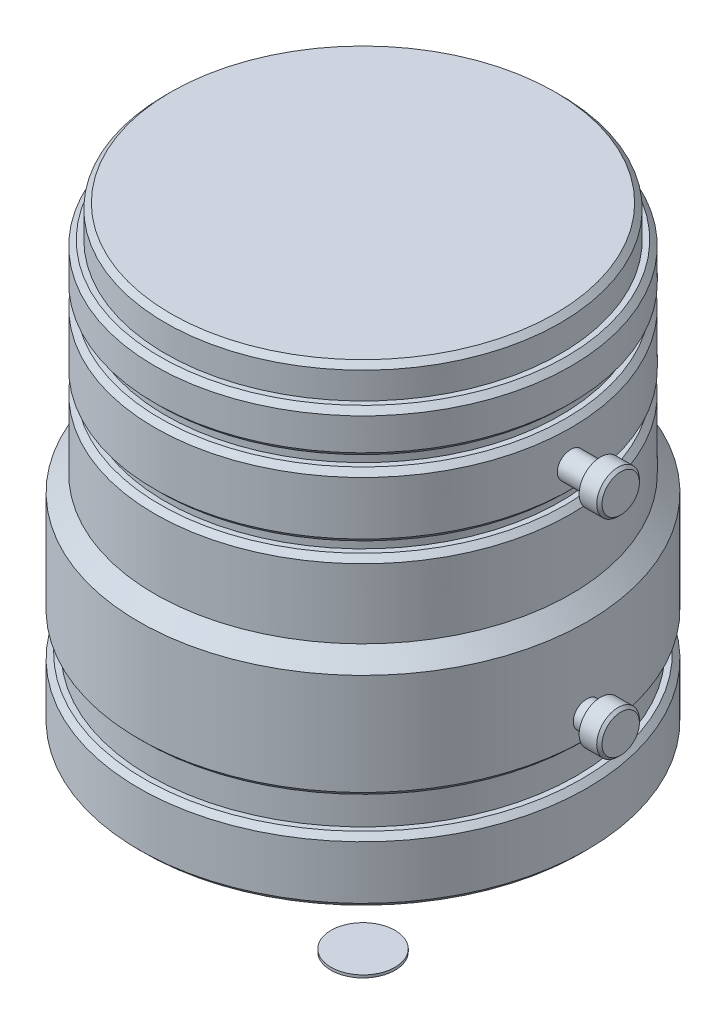
ISO-10303-21;
HEADER;
FILE_DESCRIPTION(('STEP AP214'),'2;1');
FILE_NAME('part.step','',(''),(''),'','','');
FILE_SCHEMA(('AUTOMOTIVE_DESIGN { 1 0 10303 214 1 1 1 1 }'));
ENDSEC;
DATA;
#1=APPLICATION_CONTEXT('core data for automotive mechanical design processes');
#2=APPLICATION_PROTOCOL_DEFINITION('international standard','automotive_design',2000,#1);
#3=PRODUCT_CONTEXT('',#1,'mechanical');
#4=PRODUCT('Part','Part','',(#3));
#5=PRODUCT_RELATED_PRODUCT_CATEGORY('part','',(#4));
#6=PRODUCT_DEFINITION_FORMATION('','',#4);
#7=PRODUCT_DEFINITION_CONTEXT('part definition',#1,'design');
#8=PRODUCT_DEFINITION('design','',#6,#7);
#9=PRODUCT_DEFINITION_SHAPE('','',#8);
#10=(LENGTH_UNIT() NAMED_UNIT(*) SI_UNIT(.MILLI.,.METRE.));
#11=(NAMED_UNIT(*) PLANE_ANGLE_UNIT() SI_UNIT($,.RADIAN.));
#12=(NAMED_UNIT(*) SI_UNIT($,.STERADIAN.) SOLID_ANGLE_UNIT());
#13=UNCERTAINTY_MEASURE_WITH_UNIT(LENGTH_MEASURE(1.E-05),#10,'distance_accuracy_value','');
#14=(GEOMETRIC_REPRESENTATION_CONTEXT(3) GLOBAL_UNCERTAINTY_ASSIGNED_CONTEXT((#13)) GLOBAL_UNIT_ASSIGNED_CONTEXT((#10,
#11,#12)) REPRESENTATION_CONTEXT('',''));
#15=CARTESIAN_POINT('',(0.,0.,0.));
#16=DIRECTION('',(0.,0.,1.));
#17=DIRECTION('',(1.,0.,0.));
#18=AXIS2_PLACEMENT_3D('',#15,#16,#17);
#19=CARTESIAN_POINT('',(0.,-60.53,0.));
#20=DIRECTION('',(0.,-1.,0.));
#21=DIRECTION('',(1.,0.,0.));
#22=AXIS2_PLACEMENT_3D('',#19,#20,#21);
#23=CYLINDRICAL_SURFACE('',#22,3.);
#24=CARTESIAN_POINT('',(0.,-60.53,0.));
#25=DIRECTION('',(0.,1.,0.));
#26=DIRECTION('',(-1.,0.,0.));
#27=AXIS2_PLACEMENT_3D('',#24,#25,#26);
#28=CIRCLE('',#27,3.);
#29=CARTESIAN_POINT('',(-2.99999999999999,-60.53,0.));
#30=VERTEX_POINT('',#29);
#31=EDGE_CURVE('E11',#30,#30,#28,.T.);
#32=ORIENTED_EDGE('',*,*,#31,.F.);
#33=EDGE_LOOP('',(#32));
#34=FACE_BOUND('',#33,.T.);
#35=CARTESIAN_POINT('',(0.,-60.78,0.));
#36=DIRECTION('',(0.,1.,0.));
#37=DIRECTION('',(-1.,0.,0.));
#38=AXIS2_PLACEMENT_3D('',#35,#36,#37);
#39=CIRCLE('',#38,3.);
#40=CARTESIAN_POINT('',(-2.99999999999999,-60.78,0.));
#41=VERTEX_POINT('',#40);
#42=EDGE_CURVE('E50',#41,#41,#39,.T.);
#43=ORIENTED_EDGE('',*,*,#42,.T.);
#44=EDGE_LOOP('',(#43));
#45=FACE_BOUND('',#44,.T.);
#46=ADVANCED_FACE('F47',(#34,#45),#23,.T.);
#47=CARTESIAN_POINT('',(0.,-60.53,0.));
#48=DIRECTION('',(0.,1.,0.));
#49=DIRECTION('',(-1.,0.,0.));
#50=AXIS2_PLACEMENT_3D('',#47,#48,#49);
#51=PLANE('',#50);
#52=ORIENTED_EDGE('',*,*,#31,.T.);
#53=EDGE_LOOP('',(#52));
#54=FACE_BOUND('',#53,.T.);
#55=ADVANCED_FACE('F62',(#54),#51,.T.);
#56=CARTESIAN_POINT('',(0.,-60.78,0.));
#57=DIRECTION('',(0.,1.,0.));
#58=DIRECTION('',(-1.,0.,0.));
#59=AXIS2_PLACEMENT_3D('',#56,#57,#58);
#60=PLANE('',#59);
#61=ORIENTED_EDGE('',*,*,#42,.F.);
#62=EDGE_LOOP('',(#61));
#63=FACE_BOUND('',#62,.T.);
#64=ADVANCED_FACE('F60',(#63),#60,.F.);
#65=CLOSED_SHELL('',(#46,#55,#64));
#66=MANIFOLD_SOLID_BREP('B2',#65);
#67=CARTESIAN_POINT('',(18.5,-11.5,0.));
#68=DIRECTION('',(1.,0.,0.));
#69=DIRECTION('',(0.,1.,0.));
#70=AXIS2_PLACEMENT_3D('',#67,#68,#69);
#71=PLANE('',#70);
#72=CARTESIAN_POINT('',(18.5,-11.5,0.));
#73=DIRECTION('',(1.,0.,0.));
#74=DIRECTION('',(0.,1.,0.));
#75=AXIS2_PLACEMENT_3D('',#72,#73,#74);
#76=CIRCLE('',#75,1.25);
#77=CARTESIAN_POINT('',(18.5,-10.25,0.));
#78=VERTEX_POINT('',#77);
#79=EDGE_CURVE('E107',#78,#78,#76,.T.);
#80=ORIENTED_EDGE('',*,*,#79,.F.);
#81=EDGE_LOOP('',(#80));
#82=FACE_BOUND('',#81,.T.);
#83=ADVANCED_FACE('F95',(#82),#71,.F.);
#84=CARTESIAN_POINT('',(24.15,-11.5,0.));
#85=DIRECTION('',(1.,0.,0.));
#86=DIRECTION('',(0.,1.,0.));
#87=AXIS2_PLACEMENT_3D('',#84,#85,#86);
#88=CYLINDRICAL_SURFACE('',#87,1.25);
#89=CARTESIAN_POINT('',(22.25,-11.5,0.));
#90=DIRECTION('',(1.,0.,0.));
#91=DIRECTION('',(0.,1.,0.));
#92=AXIS2_PLACEMENT_3D('',#89,#90,#91);
#93=CIRCLE('',#92,1.25);
#94=CARTESIAN_POINT('',(22.25,-10.25,0.));
#95=VERTEX_POINT('',#94);
#96=EDGE_CURVE('E111',#95,#95,#93,.T.);
#97=ORIENTED_EDGE('',*,*,#96,.F.);
#98=EDGE_LOOP('',(#97));
#99=FACE_BOUND('',#98,.T.);
#100=ORIENTED_EDGE('',*,*,#79,.T.);
#101=EDGE_LOOP('',(#100));
#102=FACE_BOUND('',#101,.T.);
#103=ADVANCED_FACE('F125',(#99,#102),#88,.T.);
#104=CARTESIAN_POINT('',(22.25,-12.75,0.));
#105=DIRECTION('',(1.,0.,0.));
#106=DIRECTION('',(0.,1.,0.));
#107=AXIS2_PLACEMENT_3D('',#104,#105,#106);
#108=PLANE('',#107);
#109=CARTESIAN_POINT('',(22.25,-11.5,0.));
#110=DIRECTION('',(1.,0.,0.));
#111=DIRECTION('',(0.,1.,0.));
#112=AXIS2_PLACEMENT_3D('',#109,#110,#111);
#113=CIRCLE('',#112,2.);
#114=CARTESIAN_POINT('',(22.25,-9.49999999999999,0.));
#115=VERTEX_POINT('',#114);
#116=EDGE_CURVE('E116',#115,#115,#113,.T.);
#117=ORIENTED_EDGE('',*,*,#116,.F.);
#118=EDGE_LOOP('',(#117));
#119=FACE_BOUND('',#118,.T.);
#120=ORIENTED_EDGE('',*,*,#96,.T.);
#121=EDGE_LOOP('',(#120));
#122=FACE_BOUND('',#121,.T.);
#123=ADVANCED_FACE('F122',(#119,#122),#108,.F.);
#124=CARTESIAN_POINT('',(24.15,-11.5,0.));
#125=DIRECTION('',(1.,0.,0.));
#126=DIRECTION('',(0.,1.,0.));
#127=AXIS2_PLACEMENT_3D('',#124,#125,#126);
#128=CYLINDRICAL_SURFACE('',#127,2.);
#129=CARTESIAN_POINT('',(23.9,-11.5,0.));
#130=DIRECTION('',(-1.,0.,0.));
#131=DIRECTION('',(0.,0.,1.));
#132=AXIS2_PLACEMENT_3D('',#129,#130,#131);
#133=CIRCLE('',#132,2.);
#134=CARTESIAN_POINT('',(23.9,-11.5,2.));
#135=VERTEX_POINT('',#134);
#136=EDGE_CURVE('E46',#135,#135,#133,.T.);
#137=ORIENTED_EDGE('',*,*,#136,.T.);
#138=EDGE_LOOP('',(#137));
#139=FACE_BOUND('',#138,.T.);
#140=ORIENTED_EDGE('',*,*,#116,.T.);
#141=EDGE_LOOP('',(#140));
#142=FACE_BOUND('',#141,.T.);
#143=ADVANCED_FACE('F120',(#139,#142),#128,.T.);
#144=CARTESIAN_POINT('',(24.15,-13.5,0.));
#145=DIRECTION('',(-1.,0.,0.));
#146=DIRECTION('',(0.,-1.,0.));
#147=AXIS2_PLACEMENT_3D('',#144,#145,#146);
#148=PLANE('',#147);
#149=CARTESIAN_POINT('',(24.15,-11.5,0.));
#150=DIRECTION('',(-1.,0.,0.));
#151=DIRECTION('',(0.,-1.,0.));
#152=AXIS2_PLACEMENT_3D('',#149,#150,#151);
#153=CIRCLE('',#152,1.75000000000001);
#154=CARTESIAN_POINT('',(24.15,-13.25,0.));
#155=VERTEX_POINT('',#154);
#156=EDGE_CURVE('E103',#155,#155,#153,.F.);
#157=ORIENTED_EDGE('',*,*,#156,.T.);
#158=EDGE_LOOP('',(#157));
#159=FACE_BOUND('',#158,.T.);
#160=ADVANCED_FACE('F140',(#159),#148,.F.);
#161=CARTESIAN_POINT('',(24.15,-11.5,0.));
#162=DIRECTION('',(-1.,0.,0.));
#163=DIRECTION('',(0.,0.,1.));
#164=AXIS2_PLACEMENT_3D('',#161,#162,#163);
#165=CONICAL_SURFACE('',#164,1.75000000000001,0.785398163397445);
#166=ORIENTED_EDGE('',*,*,#136,.F.);
#167=EDGE_LOOP('',(#166));
#168=FACE_BOUND('',#167,.T.);
#169=ORIENTED_EDGE('',*,*,#156,.F.);
#170=EDGE_LOOP('',(#169));
#171=FACE_BOUND('',#170,.T.);
#172=ADVANCED_FACE('F98',(#168,#171),#165,.T.);
#173=CLOSED_SHELL('',(#83,#103,#123,#143,#160,#172));
#174=MANIFOLD_SOLID_BREP('B6',#173);
#175=CARTESIAN_POINT('',(20.,-32.25,0.));
#176=DIRECTION('',(1.,0.,0.));
#177=DIRECTION('',(0.,0.,-1.));
#178=AXIS2_PLACEMENT_3D('',#175,#176,#177);
#179=PLANE('',#178);
#180=CARTESIAN_POINT('',(20.,-31.,0.));
#181=DIRECTION('',(1.,0.,0.));
#182=DIRECTION('',(0.,0.,-1.));
#183=AXIS2_PLACEMENT_3D('',#180,#181,#182);
#184=CIRCLE('',#183,1.25);
#185=CARTESIAN_POINT('',(20.,-31.,-1.25));
#186=VERTEX_POINT('',#185);
#187=EDGE_CURVE('E202',#186,#186,#184,.T.);
#188=ORIENTED_EDGE('',*,*,#187,.F.);
#189=EDGE_LOOP('',(#188));
#190=FACE_BOUND('',#189,.T.);
#191=ADVANCED_FACE('F190',(#190),#179,.F.);
#192=CARTESIAN_POINT('',(24.15,-31.,0.));
#193=DIRECTION('',(1.,0.,0.));
#194=DIRECTION('',(0.,0.,-1.));
#195=AXIS2_PLACEMENT_3D('',#192,#193,#194);
#196=CYLINDRICAL_SURFACE('',#195,1.25);
#197=CARTESIAN_POINT('',(22.25,-31.,0.));
#198=DIRECTION('',(1.,0.,0.));
#199=DIRECTION('',(0.,0.,-1.));
#200=AXIS2_PLACEMENT_3D('',#197,#198,#199);
#201=CIRCLE('',#200,1.25);
#202=CARTESIAN_POINT('',(22.25,-31.,-1.25));
#203=VERTEX_POINT('',#202);
#204=EDGE_CURVE('E206',#203,#203,#201,.T.);
#205=ORIENTED_EDGE('',*,*,#204,.F.);
#206=EDGE_LOOP('',(#205));
#207=FACE_BOUND('',#206,.T.);
#208=ORIENTED_EDGE('',*,*,#187,.T.);
#209=EDGE_LOOP('',(#208));
#210=FACE_BOUND('',#209,.T.);
#211=ADVANCED_FACE('F220',(#207,#210),#196,.T.);
#212=CARTESIAN_POINT('',(22.25,-32.25,0.));
#213=DIRECTION('',(1.,0.,0.));
#214=DIRECTION('',(0.,0.,-1.));
#215=AXIS2_PLACEMENT_3D('',#212,#213,#214);
#216=PLANE('',#215);
#217=CARTESIAN_POINT('',(22.25,-31.,0.));
#218=DIRECTION('',(1.,0.,0.));
#219=DIRECTION('',(0.,0.,-1.));
#220=AXIS2_PLACEMENT_3D('',#217,#218,#219);
#221=CIRCLE('',#220,2.);
#222=CARTESIAN_POINT('',(22.25,-31.,-2.));
#223=VERTEX_POINT('',#222);
#224=EDGE_CURVE('E211',#223,#223,#221,.T.);
#225=ORIENTED_EDGE('',*,*,#224,.F.);
#226=EDGE_LOOP('',(#225));
#227=FACE_BOUND('',#226,.T.);
#228=ORIENTED_EDGE('',*,*,#204,.T.);
#229=EDGE_LOOP('',(#228));
#230=FACE_BOUND('',#229,.T.);
#231=ADVANCED_FACE('F217',(#227,#230),#216,.F.);
#232=CARTESIAN_POINT('',(24.15,-31.,0.));
#233=DIRECTION('',(1.,0.,0.));
#234=DIRECTION('',(0.,0.,-1.));
#235=AXIS2_PLACEMENT_3D('',#232,#233,#234);
#236=CYLINDRICAL_SURFACE('',#235,2.);
#237=CARTESIAN_POINT('',(23.9,-31.,0.));
#238=DIRECTION('',(-1.,0.,0.));
#239=DIRECTION('',(0.,0.,1.));
#240=AXIS2_PLACEMENT_3D('',#237,#238,#239);
#241=CIRCLE('',#240,2.);
#242=CARTESIAN_POINT('',(23.9,-31.,2.));
#243=VERTEX_POINT('',#242);
#244=EDGE_CURVE('E94',#243,#243,#241,.T.);
#245=ORIENTED_EDGE('',*,*,#244,.T.);
#246=EDGE_LOOP('',(#245));
#247=FACE_BOUND('',#246,.T.);
#248=ORIENTED_EDGE('',*,*,#224,.T.);
#249=EDGE_LOOP('',(#248));
#250=FACE_BOUND('',#249,.T.);
#251=ADVANCED_FACE('F215',(#247,#250),#236,.T.);
#252=CARTESIAN_POINT('',(24.15,-33.,0.));
#253=DIRECTION('',(-1.,0.,0.));
#254=DIRECTION('',(0.,0.,1.));
#255=AXIS2_PLACEMENT_3D('',#252,#253,#254);
#256=PLANE('',#255);
#257=CARTESIAN_POINT('',(24.15,-31.,0.));
#258=DIRECTION('',(-1.,0.,0.));
#259=DIRECTION('',(0.,0.,1.));
#260=AXIS2_PLACEMENT_3D('',#257,#258,#259);
#261=CIRCLE('',#260,1.75);
#262=CARTESIAN_POINT('',(24.15,-31.,1.75));
#263=VERTEX_POINT('',#262);
#264=EDGE_CURVE('E198',#263,#263,#261,.F.);
#265=ORIENTED_EDGE('',*,*,#264,.T.);
#266=EDGE_LOOP('',(#265));
#267=FACE_BOUND('',#266,.T.);
#268=ADVANCED_FACE('F235',(#267),#256,.F.);
#269=CARTESIAN_POINT('',(24.15,-31.,0.));
#270=DIRECTION('',(-1.,0.,0.));
#271=DIRECTION('',(0.,0.,1.));
#272=AXIS2_PLACEMENT_3D('',#269,#270,#271);
#273=CONICAL_SURFACE('',#272,1.75,0.785398163397445);
#274=ORIENTED_EDGE('',*,*,#244,.F.);
#275=EDGE_LOOP('',(#274));
#276=FACE_BOUND('',#275,.T.);
#277=ORIENTED_EDGE('',*,*,#264,.F.);
#278=EDGE_LOOP('',(#277));
#279=FACE_BOUND('',#278,.T.);
#280=ADVANCED_FACE('F193',(#276,#279),#273,.T.);
#281=CLOSED_SHELL('',(#191,#211,#231,#251,#268,#280));
#282=MANIFOLD_SOLID_BREP('B41',#281);
#283=CARTESIAN_POINT('',(0.,0.,0.));
#284=DIRECTION('',(0.,-1.,0.));
#285=DIRECTION('',(1.,0.,0.));
#286=AXIS2_PLACEMENT_3D('',#283,#284,#285);
#287=PLANE('',#286);
#288=CARTESIAN_POINT('',(0.,0.,0.));
#289=DIRECTION('',(0.,-1.,0.));
#290=DIRECTION('',(1.,0.,0.));
#291=AXIS2_PLACEMENT_3D('',#288,#289,#290);
#292=CIRCLE('',#291,18.);
#293=CARTESIAN_POINT('',(18.,0.,0.));
#294=VERTEX_POINT('',#293);
#295=EDGE_CURVE('E305',#294,#294,#292,.F.);
#296=ORIENTED_EDGE('',*,*,#295,.T.);
#297=EDGE_LOOP('',(#296));
#298=FACE_BOUND('',#297,.T.);
#299=ADVANCED_FACE('F278',(#298),#287,.F.);
#300=CARTESIAN_POINT('',(0.,0.,0.));
#301=DIRECTION('',(0.,1.,0.));
#302=DIRECTION('',(-1.,0.,0.));
#303=AXIS2_PLACEMENT_3D('',#300,#301,#302);
#304=CYLINDRICAL_SURFACE('',#303,18.5);
#305=CARTESIAN_POINT('',(0.,-0.49999999999997,0.));
#306=DIRECTION('',(0.,-1.,0.));
#307=DIRECTION('',(1.,0.,0.));
#308=AXIS2_PLACEMENT_3D('',#305,#306,#307);
#309=CIRCLE('',#308,18.5);
#310=CARTESIAN_POINT('',(18.5,-0.499999999999968,0.));
#311=VERTEX_POINT('',#310);
#312=EDGE_CURVE('E302',#311,#311,#309,.T.);
#313=ORIENTED_EDGE('',*,*,#312,.T.);
#314=EDGE_LOOP('',(#313));
#315=FACE_BOUND('',#314,.T.);
#316=CARTESIAN_POINT('',(0.,-3.,0.));
#317=DIRECTION('',(0.,1.,0.));
#318=DIRECTION('',(-1.,0.,0.));
#319=AXIS2_PLACEMENT_3D('',#316,#317,#318);
#320=CIRCLE('',#319,18.5);
#321=CARTESIAN_POINT('',(-18.5,-3.,0.));
#322=VERTEX_POINT('',#321);
#323=EDGE_CURVE('E359',#322,#322,#320,.T.);
#324=ORIENTED_EDGE('',*,*,#323,.T.);
#325=EDGE_LOOP('',(#324));
#326=FACE_BOUND('',#325,.T.);
#327=ADVANCED_FACE('F422',(#315,#326),#304,.T.);
#328=CARTESIAN_POINT('',(18.5,-3.,0.));
#329=DIRECTION('',(0.,-1.,0.));
#330=DIRECTION('',(1.,0.,0.));
#331=AXIS2_PLACEMENT_3D('',#328,#329,#330);
#332=PLANE('',#331);
#333=CARTESIAN_POINT('',(0.,-3.,0.));
#334=DIRECTION('',(0.,-1.,0.));
#335=DIRECTION('',(1.,0.,0.));
#336=AXIS2_PLACEMENT_3D('',#333,#334,#335);
#337=CIRCLE('',#336,19.);
#338=CARTESIAN_POINT('',(19.,-3.,0.));
#339=VERTEX_POINT('',#338);
#340=EDGE_CURVE('E308',#339,#339,#337,.F.);
#341=ORIENTED_EDGE('',*,*,#340,.T.);
#342=EDGE_LOOP('',(#341));
#343=FACE_BOUND('',#342,.T.);
#344=ORIENTED_EDGE('',*,*,#323,.F.);
#345=EDGE_LOOP('',(#344));
#346=FACE_BOUND('',#345,.T.);
#347=ADVANCED_FACE('F428',(#343,#346),#332,.F.);
#348=CARTESIAN_POINT('',(0.,0.,0.));
#349=DIRECTION('',(0.,1.,0.));
#350=DIRECTION('',(-1.,0.,0.));
#351=AXIS2_PLACEMENT_3D('',#348,#349,#350);
#352=CYLINDRICAL_SURFACE('',#351,19.5);
#353=CARTESIAN_POINT('',(0.,-6.5,0.));
#354=DIRECTION('',(0.,1.,0.));
#355=DIRECTION('',(-1.,0.,0.));
#356=AXIS2_PLACEMENT_3D('',#353,#354,#355);
#357=CIRCLE('',#356,19.5);
#358=CARTESIAN_POINT('',(-19.5,-6.50000000000001,0.));
#359=VERTEX_POINT('',#358);
#360=EDGE_CURVE('E314',#359,#359,#357,.T.);
#361=ORIENTED_EDGE('',*,*,#360,.T.);
#362=EDGE_LOOP('',(#361));
#363=FACE_BOUND('',#362,.T.);
#364=CARTESIAN_POINT('',(0.,-3.49999999999996,0.));
#365=DIRECTION('',(0.,-1.,0.));
#366=DIRECTION('',(1.,0.,0.));
#367=AXIS2_PLACEMENT_3D('',#364,#365,#366);
#368=CIRCLE('',#367,19.5);
#369=CARTESIAN_POINT('',(19.5,-3.49999999999996,0.));
#370=VERTEX_POINT('',#369);
#371=EDGE_CURVE('E317',#370,#370,#368,.T.);
#372=ORIENTED_EDGE('',*,*,#371,.T.);
#373=EDGE_LOOP('',(#372));
#374=FACE_BOUND('',#373,.T.);
#375=ADVANCED_FACE('F590',(#363,#374),#352,.T.);
#376=CARTESIAN_POINT('',(19.5,-7.,0.));
#377=DIRECTION('',(0.,1.,0.));
#378=DIRECTION('',(-1.,0.,0.));
#379=AXIS2_PLACEMENT_3D('',#376,#377,#378);
#380=PLANE('',#379);
#381=CARTESIAN_POINT('',(0.,-7.,0.));
#382=DIRECTION('',(0.,1.,0.));
#383=DIRECTION('',(-1.,0.,0.));
#384=AXIS2_PLACEMENT_3D('',#381,#382,#383);
#385=CIRCLE('',#384,19.);
#386=CARTESIAN_POINT('',(-19.,-7.00000000000001,0.));
#387=VERTEX_POINT('',#386);
#388=EDGE_CURVE('E311',#387,#387,#385,.F.);
#389=ORIENTED_EDGE('',*,*,#388,.T.);
#390=EDGE_LOOP('',(#389));
#391=FACE_BOUND('',#390,.T.);
#392=CARTESIAN_POINT('',(0.,-7.,0.));
#393=DIRECTION('',(0.,1.,0.));
#394=DIRECTION('',(-1.,0.,0.));
#395=AXIS2_PLACEMENT_3D('',#392,#393,#394);
#396=CIRCLE('',#395,18.5);
#397=CARTESIAN_POINT('',(-18.5,-7.00000000000001,0.));
#398=VERTEX_POINT('',#397);
#399=EDGE_CURVE('E362',#398,#398,#396,.T.);
#400=ORIENTED_EDGE('',*,*,#399,.T.);
#401=EDGE_LOOP('',(#400));
#402=FACE_BOUND('',#401,.T.);
#403=ADVANCED_FACE('F586',(#391,#402),#380,.F.);
#404=CARTESIAN_POINT('',(0.,0.,0.));
#405=DIRECTION('',(0.,1.,0.));
#406=DIRECTION('',(-1.,0.,0.));
#407=AXIS2_PLACEMENT_3D('',#404,#405,#406);
#408=CYLINDRICAL_SURFACE('',#407,18.5);
#409=ORIENTED_EDGE('',*,*,#399,.F.);
#410=EDGE_LOOP('',(#409));
#411=FACE_BOUND('',#410,.T.);
#412=CARTESIAN_POINT('',(0.,-8.,0.));
#413=DIRECTION('',(0.,1.,0.));
#414=DIRECTION('',(-1.,0.,0.));
#415=AXIS2_PLACEMENT_3D('',#412,#413,#414);
#416=CIRCLE('',#415,18.5);
#417=CARTESIAN_POINT('',(-18.5,-8.,0.));
#418=VERTEX_POINT('',#417);
#419=EDGE_CURVE('E365',#418,#418,#416,.T.);
#420=ORIENTED_EDGE('',*,*,#419,.T.);
#421=EDGE_LOOP('',(#420));
#422=FACE_BOUND('',#421,.T.);
#423=ADVANCED_FACE('F582',(#411,#422),#408,.T.);
#424=CARTESIAN_POINT('',(18.5,-8.,0.));
#425=DIRECTION('',(0.,-1.,0.));
#426=DIRECTION('',(1.,0.,0.));
#427=AXIS2_PLACEMENT_3D('',#424,#425,#426);
#428=PLANE('',#427);
#429=CARTESIAN_POINT('',(0.,-8.,0.));
#430=DIRECTION('',(0.,-1.,0.));
#431=DIRECTION('',(1.,0.,0.));
#432=AXIS2_PLACEMENT_3D('',#429,#430,#431);
#433=CIRCLE('',#432,19.);
#434=CARTESIAN_POINT('',(19.,-8.,0.));
#435=VERTEX_POINT('',#434);
#436=EDGE_CURVE('E320',#435,#435,#433,.F.);
#437=ORIENTED_EDGE('',*,*,#436,.T.);
#438=EDGE_LOOP('',(#437));
#439=FACE_BOUND('',#438,.T.);
#440=ORIENTED_EDGE('',*,*,#419,.F.);
#441=EDGE_LOOP('',(#440));
#442=FACE_BOUND('',#441,.T.);
#443=ADVANCED_FACE('F578',(#439,#442),#428,.F.);
#444=CARTESIAN_POINT('',(0.,0.,0.));
#445=DIRECTION('',(0.,1.,0.));
#446=DIRECTION('',(-1.,0.,0.));
#447=AXIS2_PLACEMENT_3D('',#444,#445,#446);
#448=CYLINDRICAL_SURFACE('',#447,19.5);
#449=CARTESIAN_POINT('',(0.,-13.5,0.));
#450=DIRECTION('',(0.,1.,0.));
#451=DIRECTION('',(-1.,0.,0.));
#452=AXIS2_PLACEMENT_3D('',#449,#450,#451);
#453=CIRCLE('',#452,19.5);
#454=CARTESIAN_POINT('',(-19.5,-13.5,0.));
#455=VERTEX_POINT('',#454);
#456=EDGE_CURVE('E326',#455,#455,#453,.T.);
#457=ORIENTED_EDGE('',*,*,#456,.T.);
#458=EDGE_LOOP('',(#457));
#459=FACE_BOUND('',#458,.T.);
#460=CARTESIAN_POINT('',(0.,-8.5,0.));
#461=DIRECTION('',(0.,-1.,0.));
#462=DIRECTION('',(1.,0.,0.));
#463=AXIS2_PLACEMENT_3D('',#460,#461,#462);
#464=CIRCLE('',#463,19.5);
#465=CARTESIAN_POINT('',(19.5,-8.5,0.));
#466=VERTEX_POINT('',#465);
#467=EDGE_CURVE('E329',#466,#466,#464,.T.);
#468=ORIENTED_EDGE('',*,*,#467,.T.);
#469=EDGE_LOOP('',(#468));
#470=FACE_BOUND('',#469,.T.);
#471=ADVANCED_FACE('F574',(#459,#470),#448,.T.);
#472=CARTESIAN_POINT('',(19.5,-14.,0.));
#473=DIRECTION('',(0.,1.,0.));
#474=DIRECTION('',(-1.,0.,0.));
#475=AXIS2_PLACEMENT_3D('',#472,#473,#474);
#476=PLANE('',#475);
#477=CARTESIAN_POINT('',(0.,-14.,0.));
#478=DIRECTION('',(0.,1.,0.));
#479=DIRECTION('',(-1.,0.,0.));
#480=AXIS2_PLACEMENT_3D('',#477,#478,#479);
#481=CIRCLE('',#480,19.);
#482=CARTESIAN_POINT('',(-19.,-14.,0.));
#483=VERTEX_POINT('',#482);
#484=EDGE_CURVE('E323',#483,#483,#481,.F.);
#485=ORIENTED_EDGE('',*,*,#484,.T.);
#486=EDGE_LOOP('',(#485));
#487=FACE_BOUND('',#486,.T.);
#488=CARTESIAN_POINT('',(0.,-14.,0.));
#489=DIRECTION('',(0.,1.,0.));
#490=DIRECTION('',(-1.,0.,0.));
#491=AXIS2_PLACEMENT_3D('',#488,#489,#490);
#492=CIRCLE('',#491,18.5);
#493=CARTESIAN_POINT('',(-18.5,-14.,0.));
#494=VERTEX_POINT('',#493);
#495=EDGE_CURVE('E368',#494,#494,#492,.T.);
#496=ORIENTED_EDGE('',*,*,#495,.T.);
#497=EDGE_LOOP('',(#496));
#498=FACE_BOUND('',#497,.T.);
#499=ADVANCED_FACE('F570',(#487,#498),#476,.F.);
#500=CARTESIAN_POINT('',(0.,0.,0.));
#501=DIRECTION('',(0.,1.,0.));
#502=DIRECTION('',(-1.,0.,0.));
#503=AXIS2_PLACEMENT_3D('',#500,#501,#502);
#504=CYLINDRICAL_SURFACE('',#503,18.5);
#505=ORIENTED_EDGE('',*,*,#495,.F.);
#506=EDGE_LOOP('',(#505));
#507=FACE_BOUND('',#506,.T.);
#508=CARTESIAN_POINT('',(0.,-15.,0.));
#509=DIRECTION('',(0.,1.,0.));
#510=DIRECTION('',(-1.,0.,0.));
#511=AXIS2_PLACEMENT_3D('',#508,#509,#510);
#512=CIRCLE('',#511,18.5);
#513=CARTESIAN_POINT('',(-18.5,-15.,0.));
#514=VERTEX_POINT('',#513);
#515=EDGE_CURVE('E371',#514,#514,#512,.T.);
#516=ORIENTED_EDGE('',*,*,#515,.T.);
#517=EDGE_LOOP('',(#516));
#518=FACE_BOUND('',#517,.T.);
#519=ADVANCED_FACE('F566',(#507,#518),#504,.T.);
#520=CARTESIAN_POINT('',(18.5,-15.,0.));
#521=DIRECTION('',(0.,-1.,0.));
#522=DIRECTION('',(1.,0.,0.));
#523=AXIS2_PLACEMENT_3D('',#520,#521,#522);
#524=PLANE('',#523);
#525=CARTESIAN_POINT('',(0.,-15.,0.));
#526=DIRECTION('',(0.,-1.,0.));
#527=DIRECTION('',(1.,0.,0.));
#528=AXIS2_PLACEMENT_3D('',#525,#526,#527);
#529=CIRCLE('',#528,19.);
#530=CARTESIAN_POINT('',(19.,-15.,0.));
#531=VERTEX_POINT('',#530);
#532=EDGE_CURVE('E335',#531,#531,#529,.F.);
#533=ORIENTED_EDGE('',*,*,#532,.T.);
#534=EDGE_LOOP('',(#533));
#535=FACE_BOUND('',#534,.T.);
#536=ORIENTED_EDGE('',*,*,#515,.F.);
#537=EDGE_LOOP('',(#536));
#538=FACE_BOUND('',#537,.T.);
#539=ADVANCED_FACE('F562',(#535,#538),#524,.F.);
#540=CARTESIAN_POINT('',(0.,0.,0.));
#541=DIRECTION('',(0.,1.,0.));
#542=DIRECTION('',(-1.,0.,0.));
#543=AXIS2_PLACEMENT_3D('',#540,#541,#542);
#544=CYLINDRICAL_SURFACE('',#543,19.5);
#545=CARTESIAN_POINT('',(0.,-15.5,0.));
#546=DIRECTION('',(0.,-1.,0.));
#547=DIRECTION('',(1.,0.,0.));
#548=AXIS2_PLACEMENT_3D('',#545,#546,#547);
#549=CIRCLE('',#548,19.5);
#550=CARTESIAN_POINT('',(19.5,-15.5,0.));
#551=VERTEX_POINT('',#550);
#552=EDGE_CURVE('E332',#551,#551,#549,.T.);
#553=ORIENTED_EDGE('',*,*,#552,.T.);
#554=EDGE_LOOP('',(#553));
#555=FACE_BOUND('',#554,.T.);
#556=CARTESIAN_POINT('',(0.,-22.,0.));
#557=DIRECTION('',(0.,1.,0.));
#558=DIRECTION('',(-1.,0.,0.));
#559=AXIS2_PLACEMENT_3D('',#556,#557,#558);
#560=CIRCLE('',#559,19.5);
#561=CARTESIAN_POINT('',(-19.5,-22.,0.));
#562=VERTEX_POINT('',#561);
#563=EDGE_CURVE('E374',#562,#562,#560,.T.);
#564=ORIENTED_EDGE('',*,*,#563,.T.);
#565=EDGE_LOOP('',(#564));
#566=FACE_BOUND('',#565,.T.);
#567=ADVANCED_FACE('F558',(#555,#566),#544,.T.);
#568=CARTESIAN_POINT('',(0.,0.,0.));
#569=DIRECTION('',(0.,1.,0.));
#570=DIRECTION('',(-1.,0.,0.));
#571=AXIS2_PLACEMENT_3D('',#568,#569,#570);
#572=CYLINDRICAL_SURFACE('',#571,21.);
#573=CARTESIAN_POINT('',(0.,-23.5,0.));
#574=DIRECTION('',(0.,-1.,0.));
#575=DIRECTION('',(1.,0.,0.));
#576=AXIS2_PLACEMENT_3D('',#573,#574,#575);
#577=CIRCLE('',#576,21.);
#578=CARTESIAN_POINT('',(21.,-23.5,0.));
#579=VERTEX_POINT('',#578);
#580=EDGE_CURVE('E299',#579,#579,#577,.T.);
#581=ORIENTED_EDGE('',*,*,#580,.T.);
#582=EDGE_LOOP('',(#581));
#583=FACE_BOUND('',#582,.T.);
#584=CARTESIAN_POINT('',(0.,-33.,0.));
#585=DIRECTION('',(0.,1.,0.));
#586=DIRECTION('',(-1.,0.,0.));
#587=AXIS2_PLACEMENT_3D('',#584,#585,#586);
#588=CIRCLE('',#587,21.);
#589=CARTESIAN_POINT('',(-21.,-33.,0.));
#590=VERTEX_POINT('',#589);
#591=EDGE_CURVE('E341',#590,#590,#588,.T.);
#592=ORIENTED_EDGE('',*,*,#591,.T.);
#593=EDGE_LOOP('',(#592));
#594=FACE_BOUND('',#593,.T.);
#595=ADVANCED_FACE('F554',(#583,#594),#572,.T.);
#596=CARTESIAN_POINT('',(21.,-33.5,0.));
#597=DIRECTION('',(0.,1.,0.));
#598=DIRECTION('',(-1.,0.,0.));
#599=AXIS2_PLACEMENT_3D('',#596,#597,#598);
#600=PLANE('',#599);
#601=CARTESIAN_POINT('',(0.,-33.5,0.));
#602=DIRECTION('',(0.,1.,0.));
#603=DIRECTION('',(-1.,0.,0.));
#604=AXIS2_PLACEMENT_3D('',#601,#602,#603);
#605=CIRCLE('',#604,20.5);
#606=CARTESIAN_POINT('',(-20.5,-33.5,0.));
#607=VERTEX_POINT('',#606);
#608=EDGE_CURVE('E338',#607,#607,#605,.F.);
#609=ORIENTED_EDGE('',*,*,#608,.T.);
#610=EDGE_LOOP('',(#609));
#611=FACE_BOUND('',#610,.T.);
#612=CARTESIAN_POINT('',(0.,-33.5,0.));
#613=DIRECTION('',(0.,1.,0.));
#614=DIRECTION('',(-1.,0.,0.));
#615=AXIS2_PLACEMENT_3D('',#612,#613,#614);
#616=CIRCLE('',#615,20.);
#617=CARTESIAN_POINT('',(-20.,-33.5,0.));
#618=VERTEX_POINT('',#617);
#619=EDGE_CURVE('E377',#618,#618,#616,.T.);
#620=ORIENTED_EDGE('',*,*,#619,.T.);
#621=EDGE_LOOP('',(#620));
#622=FACE_BOUND('',#621,.T.);
#623=ADVANCED_FACE('F550',(#611,#622),#600,.F.);
#624=CARTESIAN_POINT('',(0.,0.,0.));
#625=DIRECTION('',(0.,1.,0.));
#626=DIRECTION('',(-1.,0.,0.));
#627=AXIS2_PLACEMENT_3D('',#624,#625,#626);
#628=CYLINDRICAL_SURFACE('',#627,20.);
#629=ORIENTED_EDGE('',*,*,#619,.F.);
#630=EDGE_LOOP('',(#629));
#631=FACE_BOUND('',#630,.T.);
#632=CARTESIAN_POINT('',(0.,-36.5,0.));
#633=DIRECTION('',(0.,1.,0.));
#634=DIRECTION('',(-1.,0.,0.));
#635=AXIS2_PLACEMENT_3D('',#632,#633,#634);
#636=CIRCLE('',#635,20.);
#637=CARTESIAN_POINT('',(-20.,-36.5,0.));
#638=VERTEX_POINT('',#637);
#639=EDGE_CURVE('E380',#638,#638,#636,.T.);
#640=ORIENTED_EDGE('',*,*,#639,.T.);
#641=EDGE_LOOP('',(#640));
#642=FACE_BOUND('',#641,.T.);
#643=ADVANCED_FACE('F546',(#631,#642),#628,.T.);
#644=CARTESIAN_POINT('',(20.,-36.5,0.));
#645=DIRECTION('',(0.,-1.,0.));
#646=DIRECTION('',(1.,0.,0.));
#647=AXIS2_PLACEMENT_3D('',#644,#645,#646);
#648=PLANE('',#647);
#649=CARTESIAN_POINT('',(0.,-36.5,0.));
#650=DIRECTION('',(0.,-1.,0.));
#651=DIRECTION('',(1.,0.,0.));
#652=AXIS2_PLACEMENT_3D('',#649,#650,#651);
#653=CIRCLE('',#652,20.5);
#654=CARTESIAN_POINT('',(20.5,-36.5,0.));
#655=VERTEX_POINT('',#654);
#656=EDGE_CURVE('E344',#655,#655,#653,.F.);
#657=ORIENTED_EDGE('',*,*,#656,.T.);
#658=EDGE_LOOP('',(#657));
#659=FACE_BOUND('',#658,.T.);
#660=ORIENTED_EDGE('',*,*,#639,.F.);
#661=EDGE_LOOP('',(#660));
#662=FACE_BOUND('',#661,.T.);
#663=ADVANCED_FACE('F542',(#659,#662),#648,.F.);
#664=CARTESIAN_POINT('',(0.,0.,0.));
#665=DIRECTION('',(0.,1.,0.));
#666=DIRECTION('',(-1.,0.,0.));
#667=AXIS2_PLACEMENT_3D('',#664,#665,#666);
#668=CYLINDRICAL_SURFACE('',#667,21.);
#669=CARTESIAN_POINT('',(0.,-42.,0.));
#670=DIRECTION('',(0.,1.,0.));
#671=DIRECTION('',(-1.,0.,0.));
#672=AXIS2_PLACEMENT_3D('',#669,#670,#671);
#673=CIRCLE('',#672,21.);
#674=CARTESIAN_POINT('',(-21.,-42.,0.));
#675=VERTEX_POINT('',#674);
#676=EDGE_CURVE('E350',#675,#675,#673,.T.);
#677=ORIENTED_EDGE('',*,*,#676,.T.);
#678=EDGE_LOOP('',(#677));
#679=FACE_BOUND('',#678,.T.);
#680=CARTESIAN_POINT('',(0.,-37.,0.));
#681=DIRECTION('',(0.,-1.,0.));
#682=DIRECTION('',(1.,0.,0.));
#683=AXIS2_PLACEMENT_3D('',#680,#681,#682);
#684=CIRCLE('',#683,21.);
#685=CARTESIAN_POINT('',(21.,-37.,0.));
#686=VERTEX_POINT('',#685);
#687=EDGE_CURVE('E353',#686,#686,#684,.T.);
#688=ORIENTED_EDGE('',*,*,#687,.T.);
#689=EDGE_LOOP('',(#688));
#690=FACE_BOUND('',#689,.T.);
#691=ADVANCED_FACE('F538',(#679,#690),#668,.T.);
#692=CARTESIAN_POINT('',(21.,-42.5,0.));
#693=DIRECTION('',(0.,1.,0.));
#694=DIRECTION('',(-1.,0.,0.));
#695=AXIS2_PLACEMENT_3D('',#692,#693,#694);
#696=PLANE('',#695);
#697=CARTESIAN_POINT('',(0.,-42.5,0.));
#698=DIRECTION('',(0.,1.,0.));
#699=DIRECTION('',(-1.,0.,0.));
#700=AXIS2_PLACEMENT_3D('',#697,#698,#699);
#701=CIRCLE('',#700,20.5);
#702=CARTESIAN_POINT('',(-20.5,-42.5,0.));
#703=VERTEX_POINT('',#702);
#704=EDGE_CURVE('E347',#703,#703,#701,.F.);
#705=ORIENTED_EDGE('',*,*,#704,.T.);
#706=EDGE_LOOP('',(#705));
#707=FACE_BOUND('',#706,.T.);
#708=CARTESIAN_POINT('',(0.,-42.5,0.));
#709=DIRECTION('',(0.,1.,0.));
#710=DIRECTION('',(-1.,0.,0.));
#711=AXIS2_PLACEMENT_3D('',#708,#709,#710);
#712=CIRCLE('',#711,18.);
#713=CARTESIAN_POINT('',(-18.,-42.5,0.));
#714=VERTEX_POINT('',#713);
#715=EDGE_CURVE('E383',#714,#714,#712,.T.);
#716=ORIENTED_EDGE('',*,*,#715,.T.);
#717=EDGE_LOOP('',(#716));
#718=FACE_BOUND('',#717,.T.);
#719=ADVANCED_FACE('F531',(#707,#718),#696,.F.);
#720=CARTESIAN_POINT('',(18.,-43.,0.));
#721=DIRECTION('',(0.,1.,0.));
#722=DIRECTION('',(-1.,0.,0.));
#723=AXIS2_PLACEMENT_3D('',#720,#721,#722);
#724=PLANE('',#723);
#725=CARTESIAN_POINT('',(0.,-43.,0.));
#726=DIRECTION('',(0.,1.,0.));
#727=DIRECTION('',(-1.,0.,0.));
#728=AXIS2_PLACEMENT_3D('',#725,#726,#727);
#729=CIRCLE('',#728,17.5);
#730=CARTESIAN_POINT('',(-17.5,-43.,0.));
#731=VERTEX_POINT('',#730);
#732=EDGE_CURVE('E356',#731,#731,#729,.F.);
#733=ORIENTED_EDGE('',*,*,#732,.T.);
#734=EDGE_LOOP('',(#733));
#735=FACE_BOUND('',#734,.T.);
#736=CARTESIAN_POINT('',(0.,-43.,0.));
#737=DIRECTION('',(0.,1.,0.));
#738=DIRECTION('',(-1.,0.,0.));
#739=AXIS2_PLACEMENT_3D('',#736,#737,#738);
#740=CIRCLE('',#739,12.18);
#741=CARTESIAN_POINT('',(-12.18,-43.,0.));
#742=VERTEX_POINT('',#741);
#743=EDGE_CURVE('E386',#742,#742,#740,.T.);
#744=ORIENTED_EDGE('',*,*,#743,.T.);
#745=EDGE_LOOP('',(#744));
#746=FACE_BOUND('',#745,.T.);
#747=ADVANCED_FACE('F525',(#735,#746),#724,.F.);
#748=CARTESIAN_POINT('',(0.,0.,0.));
#749=DIRECTION('',(0.,1.,0.));
#750=DIRECTION('',(-1.,0.,0.));
#751=AXIS2_PLACEMENT_3D('',#748,#749,#750);
#752=CYLINDRICAL_SURFACE('',#751,12.18);
#753=ORIENTED_EDGE('',*,*,#743,.F.);
#754=EDGE_LOOP('',(#753));
#755=FACE_BOUND('',#754,.T.);
#756=CARTESIAN_POINT('',(0.,-43.75,0.));
#757=DIRECTION('',(0.,1.,0.));
#758=DIRECTION('',(-1.,0.,0.));
#759=AXIS2_PLACEMENT_3D('',#756,#757,#758);
#760=CIRCLE('',#759,12.18);
#761=CARTESIAN_POINT('',(-12.18,-43.75,0.));
#762=VERTEX_POINT('',#761);
#763=EDGE_CURVE('E389',#762,#762,#760,.T.);
#764=ORIENTED_EDGE('',*,*,#763,.T.);
#765=EDGE_LOOP('',(#764));
#766=FACE_BOUND('',#765,.T.);
#767=ADVANCED_FACE('F520',(#755,#766),#752,.T.);
#768=CARTESIAN_POINT('',(12.18,-43.75,0.));
#769=DIRECTION('',(0.,-1.,0.));
#770=DIRECTION('',(1.,0.,0.));
#771=AXIS2_PLACEMENT_3D('',#768,#769,#770);
#772=PLANE('',#771);
#773=CARTESIAN_POINT('',(0.,-43.75,0.));
#774=DIRECTION('',(0.,-1.,0.));
#775=DIRECTION('',(1.,0.,0.));
#776=AXIS2_PLACEMENT_3D('',#773,#774,#775);
#777=CIRCLE('',#776,12.22);
#778=CARTESIAN_POINT('',(12.22,-43.75,0.));
#779=VERTEX_POINT('',#778);
#780=EDGE_CURVE('E294',#779,#779,#777,.F.);
#781=ORIENTED_EDGE('',*,*,#780,.T.);
#782=EDGE_LOOP('',(#781));
#783=FACE_BOUND('',#782,.T.);
#784=ORIENTED_EDGE('',*,*,#763,.F.);
#785=EDGE_LOOP('',(#784));
#786=FACE_BOUND('',#785,.T.);
#787=ADVANCED_FACE('F419',(#783,#786),#772,.F.);
#788=CARTESIAN_POINT('',(0.,0.,0.));
#789=DIRECTION('',(0.,1.,0.));
#790=DIRECTION('',(-1.,0.,0.));
#791=AXIS2_PLACEMENT_3D('',#788,#789,#790);
#792=CYLINDRICAL_SURFACE('',#791,12.7);
#793=CARTESIAN_POINT('',(0.,-46.72,0.));
#794=DIRECTION('',(0.,1.,0.));
#795=DIRECTION('',(-1.,0.,0.));
#796=AXIS2_PLACEMENT_3D('',#793,#794,#795);
#797=CIRCLE('',#796,12.7);
#798=CARTESIAN_POINT('',(-12.7,-46.72,0.));
#799=VERTEX_POINT('',#798);
#800=EDGE_CURVE('E286',#799,#799,#797,.T.);
#801=ORIENTED_EDGE('',*,*,#800,.T.);
#802=EDGE_LOOP('',(#801));
#803=FACE_BOUND('',#802,.T.);
#804=CARTESIAN_POINT('',(0.,-44.03,0.));
#805=DIRECTION('',(0.,-1.,0.));
#806=DIRECTION('',(1.,0.,0.));
#807=AXIS2_PLACEMENT_3D('',#804,#805,#806);
#808=CIRCLE('',#807,12.7);
#809=CARTESIAN_POINT('',(12.7,-44.03,0.));
#810=VERTEX_POINT('',#809);
#811=EDGE_CURVE('E290',#810,#810,#808,.T.);
#812=ORIENTED_EDGE('',*,*,#811,.T.);
#813=EDGE_LOOP('',(#812));
#814=FACE_BOUND('',#813,.T.);
#815=ADVANCED_FACE('F410',(#803,#814),#792,.T.);
#816=CARTESIAN_POINT('',(12.7,-47.,0.));
#817=DIRECTION('',(0.,1.,0.));
#818=DIRECTION('',(-1.,0.,0.));
#819=AXIS2_PLACEMENT_3D('',#816,#817,#818);
#820=PLANE('',#819);
#821=CARTESIAN_POINT('',(0.,-47.,0.));
#822=DIRECTION('',(0.,-1.,0.));
#823=DIRECTION('',(1.,0.,0.));
#824=AXIS2_PLACEMENT_3D('',#821,#822,#823);
#825=CIRCLE('',#824,9.);
#826=CARTESIAN_POINT('',(9.00000000000001,-47.,0.));
#827=VERTEX_POINT('',#826);
#828=EDGE_CURVE('E393',#827,#827,#825,.T.);
#829=ORIENTED_EDGE('',*,*,#828,.F.);
#830=EDGE_LOOP('',(#829));
#831=FACE_BOUND('',#830,.T.);
#832=CARTESIAN_POINT('',(0.,-47.,0.));
#833=DIRECTION('',(0.,1.,0.));
#834=DIRECTION('',(-1.,0.,0.));
#835=AXIS2_PLACEMENT_3D('',#832,#833,#834);
#836=CIRCLE('',#835,12.22);
#837=CARTESIAN_POINT('',(-12.22,-47.,0.));
#838=VERTEX_POINT('',#837);
#839=EDGE_CURVE('E189',#838,#838,#836,.F.);
#840=ORIENTED_EDGE('',*,*,#839,.T.);
#841=EDGE_LOOP('',(#840));
#842=FACE_BOUND('',#841,.T.);
#843=ADVANCED_FACE('F407',(#831,#842),#820,.F.);
#844=CARTESIAN_POINT('',(0.,-42.5,0.));
#845=DIRECTION('',(0.,1.,0.));
#846=DIRECTION('',(-1.,0.,0.));
#847=AXIS2_PLACEMENT_3D('',#844,#845,#846);
#848=CONICAL_SURFACE('',#847,18.,0.785398163397455);
#849=ORIENTED_EDGE('',*,*,#732,.F.);
#850=EDGE_LOOP('',(#849));
#851=FACE_BOUND('',#850,.T.);
#852=ORIENTED_EDGE('',*,*,#715,.F.);
#853=EDGE_LOOP('',(#852));
#854=FACE_BOUND('',#853,.T.);
#855=ADVANCED_FACE('F409',(#851,#854),#848,.T.);
#856=CARTESIAN_POINT('',(0.,-42.,0.));
#857=DIRECTION('',(0.,1.,0.));
#858=DIRECTION('',(-1.,0.,0.));
#859=AXIS2_PLACEMENT_3D('',#856,#857,#858);
#860=CONICAL_SURFACE('',#859,21.,0.785398163397448);
#861=ORIENTED_EDGE('',*,*,#704,.F.);
#862=EDGE_LOOP('',(#861));
#863=FACE_BOUND('',#862,.T.);
#864=ORIENTED_EDGE('',*,*,#676,.F.);
#865=EDGE_LOOP('',(#864));
#866=FACE_BOUND('',#865,.T.);
#867=ADVANCED_FACE('F416',(#863,#866),#860,.T.);
#868=CARTESIAN_POINT('',(0.,-36.5,0.));
#869=DIRECTION('',(0.,-1.,0.));
#870=DIRECTION('',(1.,0.,0.));
#871=AXIS2_PLACEMENT_3D('',#868,#869,#870);
#872=CONICAL_SURFACE('',#871,20.5,0.785398163397445);
#873=ORIENTED_EDGE('',*,*,#687,.F.);
#874=EDGE_LOOP('',(#873));
#875=FACE_BOUND('',#874,.T.);
#876=ORIENTED_EDGE('',*,*,#656,.F.);
#877=EDGE_LOOP('',(#876));
#878=FACE_BOUND('',#877,.T.);
#879=ADVANCED_FACE('F442',(#875,#878),#872,.T.);
#880=CARTESIAN_POINT('',(0.,-33.,0.));
#881=DIRECTION('',(0.,1.,0.));
#882=DIRECTION('',(-1.,0.,0.));
#883=AXIS2_PLACEMENT_3D('',#880,#881,#882);
#884=CONICAL_SURFACE('',#883,21.,0.785398163397438);
#885=ORIENTED_EDGE('',*,*,#608,.F.);
#886=EDGE_LOOP('',(#885));
#887=FACE_BOUND('',#886,.T.);
#888=ORIENTED_EDGE('',*,*,#591,.F.);
#889=EDGE_LOOP('',(#888));
#890=FACE_BOUND('',#889,.T.);
#891=ADVANCED_FACE('F449',(#887,#890),#884,.T.);
#892=CARTESIAN_POINT('',(0.,-15.,0.));
#893=DIRECTION('',(0.,-1.,0.));
#894=DIRECTION('',(1.,0.,0.));
#895=AXIS2_PLACEMENT_3D('',#892,#893,#894);
#896=CONICAL_SURFACE('',#895,19.,0.785398163397448);
#897=ORIENTED_EDGE('',*,*,#552,.F.);
#898=EDGE_LOOP('',(#897));
#899=FACE_BOUND('',#898,.T.);
#900=ORIENTED_EDGE('',*,*,#532,.F.);
#901=EDGE_LOOP('',(#900));
#902=FACE_BOUND('',#901,.T.);
#903=ADVANCED_FACE('F456',(#899,#902),#896,.T.);
#904=CARTESIAN_POINT('',(0.,-13.5,0.));
#905=DIRECTION('',(0.,1.,0.));
#906=DIRECTION('',(-1.,0.,0.));
#907=AXIS2_PLACEMENT_3D('',#904,#905,#906);
#908=CONICAL_SURFACE('',#907,19.5,0.785398163397445);
#909=ORIENTED_EDGE('',*,*,#484,.F.);
#910=EDGE_LOOP('',(#909));
#911=FACE_BOUND('',#910,.T.);
#912=ORIENTED_EDGE('',*,*,#456,.F.);
#913=EDGE_LOOP('',(#912));
#914=FACE_BOUND('',#913,.T.);
#915=ADVANCED_FACE('F463',(#911,#914),#908,.T.);
#916=CARTESIAN_POINT('',(0.,-8.,0.));
#917=DIRECTION('',(0.,-1.,0.));
#918=DIRECTION('',(1.,0.,0.));
#919=AXIS2_PLACEMENT_3D('',#916,#917,#918);
#920=CONICAL_SURFACE('',#919,19.,0.785398163397452);
#921=ORIENTED_EDGE('',*,*,#467,.F.);
#922=EDGE_LOOP('',(#921));
#923=FACE_BOUND('',#922,.T.);
#924=ORIENTED_EDGE('',*,*,#436,.F.);
#925=EDGE_LOOP('',(#924));
#926=FACE_BOUND('',#925,.T.);
#927=ADVANCED_FACE('F470',(#923,#926),#920,.T.);
#928=CARTESIAN_POINT('',(0.,-6.5,0.));
#929=DIRECTION('',(0.,1.,0.));
#930=DIRECTION('',(-1.,0.,0.));
#931=AXIS2_PLACEMENT_3D('',#928,#929,#930);
#932=CONICAL_SURFACE('',#931,19.5,0.785398163397448);
#933=ORIENTED_EDGE('',*,*,#388,.F.);
#934=EDGE_LOOP('',(#933));
#935=FACE_BOUND('',#934,.T.);
#936=ORIENTED_EDGE('',*,*,#360,.F.);
#937=EDGE_LOOP('',(#936));
#938=FACE_BOUND('',#937,.T.);
#939=ADVANCED_FACE('F477',(#935,#938),#932,.T.);
#940=CARTESIAN_POINT('',(0.,-3.,0.));
#941=DIRECTION('',(0.,-1.,0.));
#942=DIRECTION('',(1.,0.,0.));
#943=AXIS2_PLACEMENT_3D('',#940,#941,#942);
#944=CONICAL_SURFACE('',#943,19.,0.785398163397452);
#945=ORIENTED_EDGE('',*,*,#371,.F.);
#946=EDGE_LOOP('',(#945));
#947=FACE_BOUND('',#946,.T.);
#948=ORIENTED_EDGE('',*,*,#340,.F.);
#949=EDGE_LOOP('',(#948));
#950=FACE_BOUND('',#949,.T.);
#951=ADVANCED_FACE('F484',(#947,#950),#944,.T.);
#952=CARTESIAN_POINT('',(0.,0.,0.));
#953=DIRECTION('',(0.,-1.,0.));
#954=DIRECTION('',(1.,0.,0.));
#955=AXIS2_PLACEMENT_3D('',#952,#953,#954);
#956=CONICAL_SURFACE('',#955,18.,0.785398163397459);
#957=ORIENTED_EDGE('',*,*,#312,.F.);
#958=EDGE_LOOP('',(#957));
#959=FACE_BOUND('',#958,.T.);
#960=ORIENTED_EDGE('',*,*,#295,.F.);
#961=EDGE_LOOP('',(#960));
#962=FACE_BOUND('',#961,.T.);
#963=ADVANCED_FACE('F491',(#959,#962),#956,.T.);
#964=CARTESIAN_POINT('',(0.,-22.,0.));
#965=DIRECTION('',(0.,-1.,0.));
#966=DIRECTION('',(1.,0.,0.));
#967=AXIS2_PLACEMENT_3D('',#964,#965,#966);
#968=CONICAL_SURFACE('',#967,19.5,0.785398163397449);
#969=ORIENTED_EDGE('',*,*,#580,.F.);
#970=EDGE_LOOP('',(#969));
#971=FACE_BOUND('',#970,.T.);
#972=ORIENTED_EDGE('',*,*,#563,.F.);
#973=EDGE_LOOP('',(#972));
#974=FACE_BOUND('',#973,.T.);
#975=ADVANCED_FACE('F498',(#971,#974),#968,.T.);
#976=CARTESIAN_POINT('',(0.,-43.75,0.));
#977=DIRECTION('',(0.,-1.,0.));
#978=DIRECTION('',(1.,0.,0.));
#979=AXIS2_PLACEMENT_3D('',#976,#977,#978);
#980=CONICAL_SURFACE('',#979,12.22,1.04272187836853);
#981=ORIENTED_EDGE('',*,*,#811,.F.);
#982=EDGE_LOOP('',(#981));
#983=FACE_BOUND('',#982,.T.);
#984=ORIENTED_EDGE('',*,*,#780,.F.);
#985=EDGE_LOOP('',(#984));
#986=FACE_BOUND('',#985,.T.);
#987=ADVANCED_FACE('F504',(#983,#986),#980,.T.);
#988=CARTESIAN_POINT('',(0.,-46.72,0.));
#989=DIRECTION('',(0.,1.,0.));
#990=DIRECTION('',(-1.,0.,0.));
#991=AXIS2_PLACEMENT_3D('',#988,#989,#990);
#992=CONICAL_SURFACE('',#991,12.7,1.04272187836854);
#993=CARTESIAN_POINT('',(-12.22,-47.,0.));
#994=CARTESIAN_POINT('',(-12.225,-46.9970833333333,0.));
#995=CARTESIAN_POINT('',(-12.23,-46.9941666666667,0.));
#996=CARTESIAN_POINT('',(-12.24,-46.9883333333333,0.));
#997=CARTESIAN_POINT('',(-12.245,-46.9854166666667,0.));
#998=CARTESIAN_POINT('',(-12.255,-46.9795833333333,0.));
#999=CARTESIAN_POINT('',(-12.26,-46.9766666666667,0.));
#1000=CARTESIAN_POINT('',(-12.27,-46.9708333333333,0.));
#1001=CARTESIAN_POINT('',(-12.275,-46.9679166666667,0.));
#1002=CARTESIAN_POINT('',(-12.285,-46.9620833333333,0.));
#1003=CARTESIAN_POINT('',(-12.29,-46.9591666666667,0.));
#1004=CARTESIAN_POINT('',(-12.3,-46.9533333333333,0.));
#1005=CARTESIAN_POINT('',(-12.305,-46.9504166666667,0.));
#1006=CARTESIAN_POINT('',(-12.315,-46.9445833333333,0.));
#1007=CARTESIAN_POINT('',(-12.32,-46.9416666666667,0.));
#1008=CARTESIAN_POINT('',(-12.33,-46.9358333333333,0.));
#1009=CARTESIAN_POINT('',(-12.335,-46.9329166666667,0.));
#1010=CARTESIAN_POINT('',(-12.345,-46.9270833333333,0.));
#1011=CARTESIAN_POINT('',(-12.35,-46.9241666666667,0.));
#1012=CARTESIAN_POINT('',(-12.36,-46.9183333333333,0.));
#1013=CARTESIAN_POINT('',(-12.365,-46.9154166666667,0.));
#1014=CARTESIAN_POINT('',(-12.375,-46.9095833333333,0.));
#1015=CARTESIAN_POINT('',(-12.38,-46.9066666666667,0.));
#1016=CARTESIAN_POINT('',(-12.39,-46.9008333333333,0.));
#1017=CARTESIAN_POINT('',(-12.395,-46.8979166666667,0.));
#1018=CARTESIAN_POINT('',(-12.405,-46.8920833333333,0.));
#1019=CARTESIAN_POINT('',(-12.41,-46.8891666666667,0.));
#1020=CARTESIAN_POINT('',(-12.42,-46.8833333333333,0.));
#1021=CARTESIAN_POINT('',(-12.425,-46.8804166666667,0.));
#1022=CARTESIAN_POINT('',(-12.435,-46.8745833333333,0.));
#1023=CARTESIAN_POINT('',(-12.44,-46.8716666666667,0.));
#1024=CARTESIAN_POINT('',(-12.45,-46.8658333333333,0.));
#1025=CARTESIAN_POINT('',(-12.455,-46.8629166666667,0.));
#1026=CARTESIAN_POINT('',(-12.465,-46.8570833333333,0.));
#1027=CARTESIAN_POINT('',(-12.47,-46.8541666666667,0.));
#1028=CARTESIAN_POINT('',(-12.48,-46.8483333333333,0.));
#1029=CARTESIAN_POINT('',(-12.485,-46.8454166666667,0.));
#1030=CARTESIAN_POINT('',(-12.495,-46.8395833333333,0.));
#1031=CARTESIAN_POINT('',(-12.5,-46.8366666666667,0.));
#1032=CARTESIAN_POINT('',(-12.51,-46.8308333333333,0.));
#1033=CARTESIAN_POINT('',(-12.515,-46.8279166666667,0.));
#1034=CARTESIAN_POINT('',(-12.525,-46.8220833333333,0.));
#1035=CARTESIAN_POINT('',(-12.53,-46.8191666666667,0.));
#1036=CARTESIAN_POINT('',(-12.54,-46.8133333333333,0.));
#1037=CARTESIAN_POINT('',(-12.545,-46.8104166666667,0.));
#1038=CARTESIAN_POINT('',(-12.555,-46.8045833333333,0.));
#1039=CARTESIAN_POINT('',(-12.56,-46.8016666666667,0.));
#1040=CARTESIAN_POINT('',(-12.57,-46.7958333333333,0.));
#1041=CARTESIAN_POINT('',(-12.575,-46.7929166666667,0.));
#1042=CARTESIAN_POINT('',(-12.585,-46.7870833333333,0.));
#1043=CARTESIAN_POINT('',(-12.59,-46.7841666666667,0.));
#1044=CARTESIAN_POINT('',(-12.6,-46.7783333333333,0.));
#1045=CARTESIAN_POINT('',(-12.605,-46.7754166666667,0.));
#1046=CARTESIAN_POINT('',(-12.615,-46.7695833333333,0.));
#1047=CARTESIAN_POINT('',(-12.62,-46.7666666666667,0.));
#1048=CARTESIAN_POINT('',(-12.63,-46.7608333333333,0.));
#1049=CARTESIAN_POINT('',(-12.635,-46.7579166666667,0.));
#1050=CARTESIAN_POINT('',(-12.645,-46.7520833333333,0.));
#1051=CARTESIAN_POINT('',(-12.65,-46.7491666666667,0.));
#1052=CARTESIAN_POINT('',(-12.66,-46.7433333333333,0.));
#1053=CARTESIAN_POINT('',(-12.665,-46.7404166666667,0.));
#1054=CARTESIAN_POINT('',(-12.675,-46.7345833333333,0.));
#1055=CARTESIAN_POINT('',(-12.68,-46.7316666666667,0.));
#1056=CARTESIAN_POINT('',(-12.69,-46.7258333333333,0.));
#1057=CARTESIAN_POINT('',(-12.695,-46.7229166666667,0.));
#1058=CARTESIAN_POINT('',(-12.7,-46.72,0.));
#1059=B_SPLINE_CURVE_WITH_KNOTS('',3,(#993,#994,#995,#996,#997,#998,#999,#1000,#1001,#1002,
#1003,#1004,#1005,#1006,#1007,#1008,#1009,#1010,#1011,#1012,#1013,#1014,#1015,#1016,#1017,#1018,
#1019,#1020,#1021,#1022,#1023,#1024,#1025,#1026,#1027,#1028,#1029,#1030,#1031,#1032,#1033,#1034,
#1035,#1036,#1037,#1038,#1039,#1040,#1041,#1042,#1043,#1044,#1045,#1046,#1047,#1048,#1049,#1050,
#1051,#1052,#1053,#1054,#1055,#1056,#1057,#1058),.UNSPECIFIED.,.F.,.F.,(4,2,2,2,2,2,2,2,2,2,2,2,
2,2,2,2,2,2,2,2,2,2,2,2,2,2,2,2,2,2,2,2,4),(0.,0.0173655549868141,0.0347311099736268,
0.0520966649604409,0.0694622199472501,0.0868277749340642,0.104193329920877,0.121558884907691,
0.1389244398945,0.156289994881314,0.173655549868127,0.191021104854941,0.208386659841752,
0.225752214828564,0.243117769815377,0.260483324802191,0.277848879789002,0.295214434775814,
0.312579989762627,0.329945544749441,0.347311099736252,0.364676654723064,0.382042209709879,
0.399407764696691,0.416773319683502,0.434138874670314,0.451504429657129,0.468869984643941,
0.486235539630755,0.503601094617564,0.520966649604379,0.538332204591191,0.555697759578005),.UNSPECIFIED.);
#1060=EDGE_CURVE('BSEAM281',#838,#799,#1059,.T.);
#1061=ORIENTED_EDGE('',*,*,#839,.F.);
#1062=ORIENTED_EDGE('',*,*,#800,.F.);
#1063=ORIENTED_EDGE('',*,*,#1060,.T.);
#1064=ORIENTED_EDGE('',*,*,#1060,.F.);
#1065=EDGE_LOOP('',(#1061,#1063,#1062,#1064));
#1066=FACE_BOUND('',#1065,.T.);
#1067=ADVANCED_FACE('F281',(#1066),#992,.T.);
#1068=CARTESIAN_POINT('',(0.,-37.,0.));
#1069=DIRECTION('',(0.,-1.,0.));
#1070=DIRECTION('',(1.,0.,0.));
#1071=AXIS2_PLACEMENT_3D('',#1068,#1069,#1070);
#1072=CYLINDRICAL_SURFACE('',#1071,9.);
#1073=CARTESIAN_POINT('',(0.,-37.,0.));
#1074=DIRECTION('',(0.,-1.,0.));
#1075=DIRECTION('',(1.,0.,0.));
#1076=AXIS2_PLACEMENT_3D('',#1073,#1074,#1075);
#1077=CIRCLE('',#1076,9.);
#1078=CARTESIAN_POINT('',(9.00000000000001,-37.,0.));
#1079=VERTEX_POINT('',#1078);
#1080=EDGE_CURVE('E392',#1079,#1079,#1077,.T.);
#1081=ORIENTED_EDGE('',*,*,#1080,.F.);
#1082=EDGE_LOOP('',(#1081));
#1083=FACE_BOUND('',#1082,.T.);
#1084=ORIENTED_EDGE('',*,*,#828,.T.);
#1085=EDGE_LOOP('',(#1084));
#1086=FACE_BOUND('',#1085,.T.);
#1087=ADVANCED_FACE('F401',(#1083,#1086),#1072,.F.);
#1088=CARTESIAN_POINT('',(0.,-37.,0.));
#1089=DIRECTION('',(0.,-1.,0.));
#1090=DIRECTION('',(1.,0.,0.));
#1091=AXIS2_PLACEMENT_3D('',#1088,#1089,#1090);
#1092=PLANE('',#1091);
#1093=ORIENTED_EDGE('',*,*,#1080,.T.);
#1094=EDGE_LOOP('',(#1093));
#1095=FACE_BOUND('',#1094,.T.);
#1096=ADVANCED_FACE('F399',(#1095),#1092,.T.);
#1097=CLOSED_SHELL('',(#299,#327,#347,#375,#403,#423,#443,#471,#499,#519,#539,#567,#595,#623,
#643,#663,#691,#719,#747,#767,#787,#815,#843,#855,#867,#879,#891,#903,#915,#927,#939,#951,#963,
#975,#987,#1067,#1087,#1096));
#1098=MANIFOLD_SOLID_BREP('B89',#1097);
#1099=ADVANCED_BREP_SHAPE_REPRESENTATION('',(#18,#66,#174,#282,#1098),#14);
#1100=SHAPE_DEFINITION_REPRESENTATION(#9,#1099);
ENDSEC;
END-ISO-10303-21;
